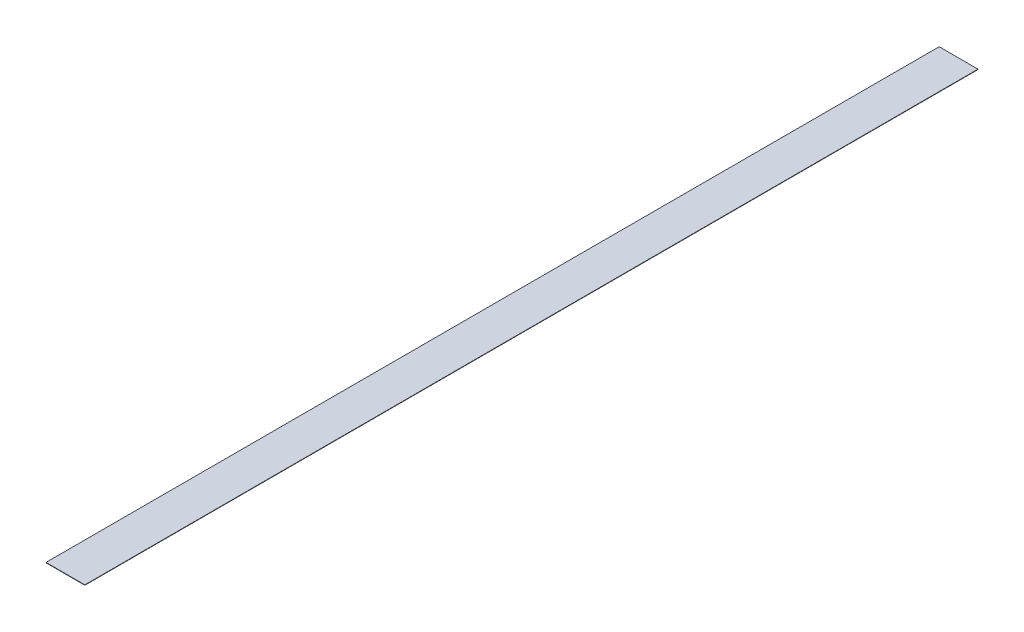
ISO-10303-21;
HEADER;
FILE_DESCRIPTION(('STEP AP214'),'2;1');
FILE_NAME('part.step','',(''),(''),'','','');
FILE_SCHEMA(('AUTOMOTIVE_DESIGN { 1 0 10303 214 1 1 1 1 }'));
ENDSEC;
DATA;
#1=APPLICATION_CONTEXT('core data for automotive mechanical design processes');
#2=APPLICATION_PROTOCOL_DEFINITION('international standard','automotive_design',2000,#1);
#3=PRODUCT_CONTEXT('',#1,'mechanical');
#4=PRODUCT('Part','Part','',(#3));
#5=PRODUCT_RELATED_PRODUCT_CATEGORY('part','',(#4));
#6=PRODUCT_DEFINITION_FORMATION('','',#4);
#7=PRODUCT_DEFINITION_CONTEXT('part definition',#1,'design');
#8=PRODUCT_DEFINITION('design','',#6,#7);
#9=PRODUCT_DEFINITION_SHAPE('','',#8);
#10=(LENGTH_UNIT() NAMED_UNIT(*) SI_UNIT(.MILLI.,.METRE.));
#11=(NAMED_UNIT(*) PLANE_ANGLE_UNIT() SI_UNIT($,.RADIAN.));
#12=(NAMED_UNIT(*) SI_UNIT($,.STERADIAN.) SOLID_ANGLE_UNIT());
#13=UNCERTAINTY_MEASURE_WITH_UNIT(LENGTH_MEASURE(1.E-05),#10,'distance_accuracy_value','');
#14=(GEOMETRIC_REPRESENTATION_CONTEXT(3) GLOBAL_UNCERTAINTY_ASSIGNED_CONTEXT((#13)) GLOBAL_UNIT_ASSIGNED_CONTEXT((#10,
#11,#12)) REPRESENTATION_CONTEXT('',''));
#15=CARTESIAN_POINT('',(0.,0.,0.));
#16=DIRECTION('',(0.,0.,1.));
#17=DIRECTION('',(1.,0.,0.));
#18=AXIS2_PLACEMENT_3D('',#15,#16,#17);
#19=CARTESIAN_POINT('',(0.,0.,0.));
#20=DIRECTION('',(0.,-1.,0.));
#21=DIRECTION('',(0.,0.,-1.));
#22=AXIS2_PLACEMENT_3D('',#19,#20,#21);
#23=PLANE('',#22);
#24=DIRECTION('',(0.,0.,-1.));
#25=VECTOR('',#24,1.);
#26=CARTESIAN_POINT('',(-12.7,0.,292.1));
#27=LINE('',#26,#25);
#28=CARTESIAN_POINT('',(-12.7,0.,292.1));
#29=VERTEX_POINT('',#28);
#30=CARTESIAN_POINT('',(-12.7,0.,-292.1));
#31=VERTEX_POINT('',#30);
#32=EDGE_CURVE('E55',#29,#31,#27,.T.);
#33=ORIENTED_EDGE('',*,*,#32,.T.);
#34=DIRECTION('',(1.,0.,0.));
#35=VECTOR('',#34,1.);
#36=CARTESIAN_POINT('',(-12.7,0.,-292.1));
#37=LINE('',#36,#35);
#38=CARTESIAN_POINT('',(12.7,0.,-292.1));
#39=VERTEX_POINT('',#38);
#40=EDGE_CURVE('E76',#31,#39,#37,.T.);
#41=ORIENTED_EDGE('',*,*,#40,.T.);
#42=DIRECTION('',(0.,0.,1.));
#43=VECTOR('',#42,1.);
#44=CARTESIAN_POINT('',(12.7,0.,292.1));
#45=LINE('',#44,#43);
#46=CARTESIAN_POINT('',(12.7,0.,292.1));
#47=VERTEX_POINT('',#46);
#48=EDGE_CURVE('E58',#39,#47,#45,.T.);
#49=ORIENTED_EDGE('',*,*,#48,.T.);
#50=DIRECTION('',(-1.,0.,0.));
#51=VECTOR('',#50,1.);
#52=CARTESIAN_POINT('',(-12.7,0.,292.1));
#53=LINE('',#52,#51);
#54=EDGE_CURVE('E20',#47,#29,#53,.T.);
#55=ORIENTED_EDGE('',*,*,#54,.T.);
#56=EDGE_LOOP('',(#33,#41,#49,#55));
#57=FACE_BOUND('',#56,.T.);
#58=ADVANCED_FACE('F17',(#57),#23,.T.);
#59=CARTESIAN_POINT('',(-12.7,0.254,292.1));
#60=DIRECTION('',(0.,0.,-1.));
#61=DIRECTION('',(-1.,0.,0.));
#62=AXIS2_PLACEMENT_3D('',#59,#60,#61);
#63=PLANE('',#62);
#64=DIRECTION('',(0.,1.,0.));
#65=VECTOR('',#64,1.);
#66=CARTESIAN_POINT('',(12.7,0.254,292.1));
#67=LINE('',#66,#65);
#68=CARTESIAN_POINT('',(12.7,0.254,292.1));
#69=VERTEX_POINT('',#68);
#70=EDGE_CURVE('E78',#47,#69,#67,.T.);
#71=ORIENTED_EDGE('',*,*,#70,.T.);
#72=DIRECTION('',(1.,0.,0.));
#73=VECTOR('',#72,1.);
#74=CARTESIAN_POINT('',(0.,0.254,292.1));
#75=LINE('',#74,#73);
#76=CARTESIAN_POINT('',(-12.7,0.254,292.1));
#77=VERTEX_POINT('',#76);
#78=EDGE_CURVE('E73',#69,#77,#75,.F.);
#79=ORIENTED_EDGE('',*,*,#78,.T.);
#80=DIRECTION('',(0.,1.,0.));
#81=VECTOR('',#80,1.);
#82=CARTESIAN_POINT('',(-12.7,0.254,292.1));
#83=LINE('',#82,#81);
#84=EDGE_CURVE('E63',#77,#29,#83,.F.);
#85=ORIENTED_EDGE('',*,*,#84,.T.);
#86=ORIENTED_EDGE('',*,*,#54,.F.);
#87=EDGE_LOOP('',(#71,#79,#85,#86));
#88=FACE_BOUND('',#87,.T.);
#89=ADVANCED_FACE('F72',(#88),#63,.F.);
#90=CARTESIAN_POINT('',(-12.7,0.254,292.1));
#91=DIRECTION('',(1.,0.,0.));
#92=DIRECTION('',(0.,0.,-1.));
#93=AXIS2_PLACEMENT_3D('',#90,#91,#92);
#94=PLANE('',#93);
#95=ORIENTED_EDGE('',*,*,#84,.F.);
#96=DIRECTION('',(0.,0.,-1.));
#97=VECTOR('',#96,1.);
#98=CARTESIAN_POINT('',(-12.7,0.254,0.));
#99=LINE('',#98,#97);
#100=CARTESIAN_POINT('',(-12.7,0.254,-292.1));
#101=VERTEX_POINT('',#100);
#102=EDGE_CURVE('E83',#77,#101,#99,.T.);
#103=ORIENTED_EDGE('',*,*,#102,.T.);
#104=DIRECTION('',(0.,1.,0.));
#105=VECTOR('',#104,1.);
#106=CARTESIAN_POINT('',(-12.7,0.254,-292.1));
#107=LINE('',#106,#105);
#108=EDGE_CURVE('E69',#101,#31,#107,.F.);
#109=ORIENTED_EDGE('',*,*,#108,.T.);
#110=ORIENTED_EDGE('',*,*,#32,.F.);
#111=EDGE_LOOP('',(#95,#103,#109,#110));
#112=FACE_BOUND('',#111,.T.);
#113=ADVANCED_FACE('F66',(#112),#94,.F.);
#114=CARTESIAN_POINT('',(-12.7,0.254,-292.1));
#115=DIRECTION('',(0.,0.,1.));
#116=DIRECTION('',(1.,0.,0.));
#117=AXIS2_PLACEMENT_3D('',#114,#115,#116);
#118=PLANE('',#117);
#119=ORIENTED_EDGE('',*,*,#108,.F.);
#120=DIRECTION('',(1.,0.,0.));
#121=VECTOR('',#120,1.);
#122=CARTESIAN_POINT('',(0.,0.254,-292.1));
#123=LINE('',#122,#121);
#124=CARTESIAN_POINT('',(12.7,0.254,-292.1));
#125=VERTEX_POINT('',#124);
#126=EDGE_CURVE('E26',#101,#125,#123,.T.);
#127=ORIENTED_EDGE('',*,*,#126,.T.);
#128=DIRECTION('',(0.,1.,0.));
#129=VECTOR('',#128,1.);
#130=CARTESIAN_POINT('',(12.7,0.254,-292.1));
#131=LINE('',#130,#129);
#132=EDGE_CURVE('E34',#125,#39,#131,.F.);
#133=ORIENTED_EDGE('',*,*,#132,.T.);
#134=ORIENTED_EDGE('',*,*,#40,.F.);
#135=EDGE_LOOP('',(#119,#127,#133,#134));
#136=FACE_BOUND('',#135,.T.);
#137=ADVANCED_FACE('F88',(#136),#118,.F.);
#138=CARTESIAN_POINT('',(12.7,0.254,292.1));
#139=DIRECTION('',(-1.,0.,0.));
#140=DIRECTION('',(0.,0.,1.));
#141=AXIS2_PLACEMENT_3D('',#138,#139,#140);
#142=PLANE('',#141);
#143=ORIENTED_EDGE('',*,*,#132,.F.);
#144=DIRECTION('',(0.,0.,-1.));
#145=VECTOR('',#144,1.);
#146=CARTESIAN_POINT('',(12.7,0.254,0.));
#147=LINE('',#146,#145);
#148=EDGE_CURVE('E11',#125,#69,#147,.F.);
#149=ORIENTED_EDGE('',*,*,#148,.T.);
#150=ORIENTED_EDGE('',*,*,#70,.F.);
#151=ORIENTED_EDGE('',*,*,#48,.F.);
#152=EDGE_LOOP('',(#143,#149,#150,#151));
#153=FACE_BOUND('',#152,.T.);
#154=ADVANCED_FACE('F91',(#153),#142,.F.);
#155=CARTESIAN_POINT('',(0.,0.254,0.));
#156=DIRECTION('',(0.,-1.,0.));
#157=DIRECTION('',(0.,0.,-1.));
#158=AXIS2_PLACEMENT_3D('',#155,#156,#157);
#159=PLANE('',#158);
#160=ORIENTED_EDGE('',*,*,#126,.F.);
#161=ORIENTED_EDGE('',*,*,#102,.F.);
#162=ORIENTED_EDGE('',*,*,#78,.F.);
#163=ORIENTED_EDGE('',*,*,#148,.F.);
#164=EDGE_LOOP('',(#160,#161,#162,#163));
#165=FACE_BOUND('',#164,.T.);
#166=ADVANCED_FACE('F90',(#165),#159,.F.);
#167=CLOSED_SHELL('',(#58,#89,#113,#137,#154,#166));
#168=MANIFOLD_SOLID_BREP('B1',#167);
#169=ADVANCED_BREP_SHAPE_REPRESENTATION('',(#18,#168),#14);
#170=SHAPE_DEFINITION_REPRESENTATION(#9,#169);
ENDSEC;
END-ISO-10303-21;
